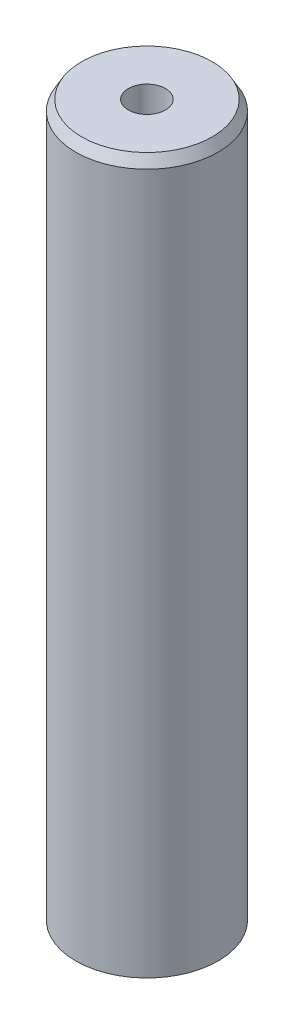
ISO-10303-21;
HEADER;
FILE_DESCRIPTION(('STEP AP214'),'2;1');
FILE_NAME('part.step','',(''),(''),'','','');
FILE_SCHEMA(('AUTOMOTIVE_DESIGN { 1 0 10303 214 1 1 1 1 }'));
ENDSEC;
DATA;
#1=APPLICATION_CONTEXT('core data for automotive mechanical design processes');
#2=APPLICATION_PROTOCOL_DEFINITION('international standard','automotive_design',2000,#1);
#3=PRODUCT_CONTEXT('',#1,'mechanical');
#4=PRODUCT('Part','Part','',(#3));
#5=PRODUCT_RELATED_PRODUCT_CATEGORY('part','',(#4));
#6=PRODUCT_DEFINITION_FORMATION('','',#4);
#7=PRODUCT_DEFINITION_CONTEXT('part definition',#1,'design');
#8=PRODUCT_DEFINITION('design','',#6,#7);
#9=PRODUCT_DEFINITION_SHAPE('','',#8);
#10=(LENGTH_UNIT() NAMED_UNIT(*) SI_UNIT(.MILLI.,.METRE.));
#11=(NAMED_UNIT(*) PLANE_ANGLE_UNIT() SI_UNIT($,.RADIAN.));
#12=(NAMED_UNIT(*) SI_UNIT($,.STERADIAN.) SOLID_ANGLE_UNIT());
#13=UNCERTAINTY_MEASURE_WITH_UNIT(LENGTH_MEASURE(1.E-05),#10,'distance_accuracy_value','');
#14=(GEOMETRIC_REPRESENTATION_CONTEXT(3) GLOBAL_UNCERTAINTY_ASSIGNED_CONTEXT((#13)) GLOBAL_UNIT_ASSIGNED_CONTEXT((#10,
#11,#12)) REPRESENTATION_CONTEXT('',''));
#15=CARTESIAN_POINT('',(0.,0.,0.));
#16=DIRECTION('',(0.,0.,1.));
#17=DIRECTION('',(1.,0.,0.));
#18=AXIS2_PLACEMENT_3D('',#15,#16,#17);
#19=CARTESIAN_POINT('',(0.,75.5116826687779,0.));
#20=DIRECTION('',(0.,-1.,0.));
#21=DIRECTION('',(0.,0.,-1.));
#22=AXIS2_PLACEMENT_3D('',#19,#20,#21);
#23=CYLINDRICAL_SURFACE('',#22,7.5);
#24=CARTESIAN_POINT('',(0.,74.4273603655304,0.));
#25=DIRECTION('',(0.,1.,0.));
#26=DIRECTION('',(0.,0.,1.));
#27=AXIS2_PLACEMENT_3D('',#24,#25,#26);
#28=CIRCLE('',#27,7.5);
#29=CARTESIAN_POINT('',(0.,74.4273603655304,7.5));
#30=VERTEX_POINT('',#29);
#31=EDGE_CURVE('E50',#30,#30,#28,.F.);
#32=ORIENTED_EDGE('',*,*,#31,.T.);
#33=EDGE_LOOP('',(#32));
#34=FACE_BOUND('',#33,.T.);
#35=CARTESIAN_POINT('',(0.,0.626033773668266,0.));
#36=DIRECTION('',(0.,1.,0.));
#37=DIRECTION('',(0.,0.,1.));
#38=AXIS2_PLACEMENT_3D('',#35,#36,#37);
#39=CIRCLE('',#38,7.5);
#40=CARTESIAN_POINT('',(0.,0.626033773668266,7.5));
#41=VERTEX_POINT('',#40);
#42=EDGE_CURVE('E51',#41,#41,#39,.T.);
#43=ORIENTED_EDGE('',*,*,#42,.T.);
#44=EDGE_LOOP('',(#43));
#45=FACE_BOUND('',#44,.T.);
#46=ADVANCED_FACE('F39',(#34,#45),#23,.T.);
#47=CARTESIAN_POINT('',(0.,75.5116826687779,0.));
#48=DIRECTION('',(0.,1.,0.));
#49=DIRECTION('',(0.,0.,1.));
#50=AXIS2_PLACEMENT_3D('',#47,#48,#49);
#51=PLANE('',#50);
#52=CARTESIAN_POINT('',(0.,75.5116826687779,0.));
#53=DIRECTION('',(0.,1.,0.));
#54=DIRECTION('',(0.,0.,1.));
#55=AXIS2_PLACEMENT_3D('',#52,#53,#54);
#56=CIRCLE('',#55,6.87396622633173);
#57=CARTESIAN_POINT('',(0.,75.5116826687779,6.87396622633173));
#58=VERTEX_POINT('',#57);
#59=EDGE_CURVE('E54',#58,#58,#56,.T.);
#60=ORIENTED_EDGE('',*,*,#59,.T.);
#61=EDGE_LOOP('',(#60));
#62=FACE_BOUND('',#61,.T.);
#63=CARTESIAN_POINT('',(0.,75.5116826687779,0.));
#64=DIRECTION('',(0.,1.,0.));
#65=DIRECTION('',(0.,0.,1.));
#66=AXIS2_PLACEMENT_3D('',#63,#64,#65);
#67=CIRCLE('',#66,1.95855166790946);
#68=CARTESIAN_POINT('',(0.,75.5116826687779,1.95855166790946));
#69=VERTEX_POINT('',#68);
#70=EDGE_CURVE('E58',#69,#69,#67,.T.);
#71=ORIENTED_EDGE('',*,*,#70,.F.);
#72=EDGE_LOOP('',(#71));
#73=FACE_BOUND('',#72,.T.);
#74=ADVANCED_FACE('F69',(#62,#73),#51,.T.);
#75=CARTESIAN_POINT('',(0.,0.,0.));
#76=DIRECTION('',(0.,1.,0.));
#77=DIRECTION('',(0.,0.,1.));
#78=AXIS2_PLACEMENT_3D('',#75,#76,#77);
#79=PLANE('',#78);
#80=CARTESIAN_POINT('',(0.,0.,0.));
#81=DIRECTION('',(0.,1.,0.));
#82=DIRECTION('',(0.,0.,1.));
#83=AXIS2_PLACEMENT_3D('',#80,#81,#82);
#84=CIRCLE('',#83,6.41567769675248);
#85=CARTESIAN_POINT('',(0.,0.,6.41567769675248));
#86=VERTEX_POINT('',#85);
#87=EDGE_CURVE('E10',#86,#86,#84,.F.);
#88=ORIENTED_EDGE('',*,*,#87,.T.);
#89=EDGE_LOOP('',(#88));
#90=FACE_BOUND('',#89,.T.);
#91=CARTESIAN_POINT('',(0.,0.,0.));
#92=DIRECTION('',(0.,1.,0.));
#93=DIRECTION('',(0.,0.,1.));
#94=AXIS2_PLACEMENT_3D('',#91,#92,#93);
#95=CIRCLE('',#94,1.95855166790946);
#96=CARTESIAN_POINT('',(0.,0.,1.95855166790946));
#97=VERTEX_POINT('',#96);
#98=EDGE_CURVE('E63',#97,#97,#95,.T.);
#99=ORIENTED_EDGE('',*,*,#98,.T.);
#100=EDGE_LOOP('',(#99));
#101=FACE_BOUND('',#100,.T.);
#102=ADVANCED_FACE('F75',(#90,#101),#79,.F.);
#103=CARTESIAN_POINT('',(0.,75.5116826687779,0.));
#104=DIRECTION('',(0.,-1.,0.));
#105=DIRECTION('',(0.,0.,-1.));
#106=AXIS2_PLACEMENT_3D('',#103,#104,#105);
#107=CYLINDRICAL_SURFACE('',#106,1.95855166790946);
#108=ORIENTED_EDGE('',*,*,#70,.T.);
#109=EDGE_LOOP('',(#108));
#110=FACE_BOUND('',#109,.T.);
#111=ORIENTED_EDGE('',*,*,#98,.F.);
#112=EDGE_LOOP('',(#111));
#113=FACE_BOUND('',#112,.T.);
#114=ADVANCED_FACE('F70',(#110,#113),#107,.F.);
#115=CARTESIAN_POINT('',(0.,75.5116826687779,0.));
#116=DIRECTION('',(0.,-1.,0.));
#117=DIRECTION('',(0.,0.,-1.));
#118=AXIS2_PLACEMENT_3D('',#115,#116,#117);
#119=CONICAL_SURFACE('',#118,6.87396622633173,0.523598775598295);
#120=ORIENTED_EDGE('',*,*,#31,.F.);
#121=EDGE_LOOP('',(#120));
#122=FACE_BOUND('',#121,.T.);
#123=ORIENTED_EDGE('',*,*,#59,.F.);
#124=EDGE_LOOP('',(#123));
#125=FACE_BOUND('',#124,.T.);
#126=ADVANCED_FACE('F81',(#122,#125),#119,.T.);
#127=CARTESIAN_POINT('',(0.,0.626033773668266,0.));
#128=DIRECTION('',(0.,1.,0.));
#129=DIRECTION('',(0.,0.,1.));
#130=AXIS2_PLACEMENT_3D('',#127,#128,#129);
#131=CONICAL_SURFACE('',#130,7.5,1.0471975511966);
#132=ORIENTED_EDGE('',*,*,#87,.F.);
#133=EDGE_LOOP('',(#132));
#134=FACE_BOUND('',#133,.T.);
#135=ORIENTED_EDGE('',*,*,#42,.F.);
#136=EDGE_LOOP('',(#135));
#137=FACE_BOUND('',#136,.T.);
#138=ADVANCED_FACE('F45',(#134,#137),#131,.T.);
#139=CLOSED_SHELL('',(#46,#74,#102,#114,#126,#138));
#140=MANIFOLD_SOLID_BREP('B2',#139);
#141=ADVANCED_BREP_SHAPE_REPRESENTATION('',(#18,#140),#14);
#142=SHAPE_DEFINITION_REPRESENTATION(#9,#141);
ENDSEC;
END-ISO-10303-21;
